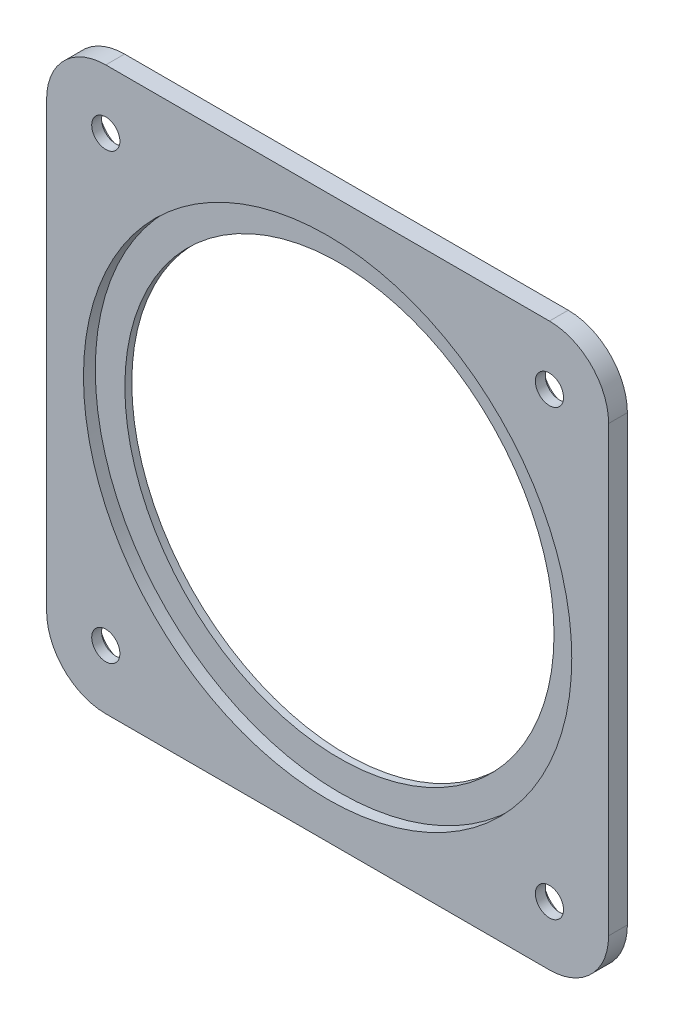
ISO-10303-21;
HEADER;
FILE_DESCRIPTION(('STEP AP214'),'2;1');
FILE_NAME('part.step','',(''),(''),'','','');
FILE_SCHEMA(('AUTOMOTIVE_DESIGN { 1 0 10303 214 1 1 1 1 }'));
ENDSEC;
DATA;
#1=APPLICATION_CONTEXT('core data for automotive mechanical design processes');
#2=APPLICATION_PROTOCOL_DEFINITION('international standard','automotive_design',2000,#1);
#3=PRODUCT_CONTEXT('',#1,'mechanical');
#4=PRODUCT('Part','Part','',(#3));
#5=PRODUCT_RELATED_PRODUCT_CATEGORY('part','',(#4));
#6=PRODUCT_DEFINITION_FORMATION('','',#4);
#7=PRODUCT_DEFINITION_CONTEXT('part definition',#1,'design');
#8=PRODUCT_DEFINITION('design','',#6,#7);
#9=PRODUCT_DEFINITION_SHAPE('','',#8);
#10=(LENGTH_UNIT() NAMED_UNIT(*) SI_UNIT(.MILLI.,.METRE.));
#11=(NAMED_UNIT(*) PLANE_ANGLE_UNIT() SI_UNIT($,.RADIAN.));
#12=(NAMED_UNIT(*) SI_UNIT($,.STERADIAN.) SOLID_ANGLE_UNIT());
#13=UNCERTAINTY_MEASURE_WITH_UNIT(LENGTH_MEASURE(1.E-05),#10,'distance_accuracy_value','');
#14=(GEOMETRIC_REPRESENTATION_CONTEXT(3) GLOBAL_UNCERTAINTY_ASSIGNED_CONTEXT((#13)) GLOBAL_UNIT_ASSIGNED_CONTEXT((#10,
#11,#12)) REPRESENTATION_CONTEXT('',''));
#15=CARTESIAN_POINT('',(0.,0.,0.));
#16=DIRECTION('',(0.,0.,1.));
#17=DIRECTION('',(1.,0.,0.));
#18=AXIS2_PLACEMENT_3D('',#15,#16,#17);
#19=CARTESIAN_POINT('',(-75.,75.,6.35));
#20=DIRECTION('',(0.,0.,-1.));
#21=DIRECTION('',(-1.,0.,0.));
#22=AXIS2_PLACEMENT_3D('',#19,#20,#21);
#23=CYLINDRICAL_SURFACE('',#22,4.7625);
#24=CARTESIAN_POINT('',(-75.,75.,6.35));
#25=DIRECTION('',(0.,0.,1.));
#26=DIRECTION('',(1.,0.,0.));
#27=AXIS2_PLACEMENT_3D('',#24,#25,#26);
#28=CIRCLE('',#27,4.7625);
#29=CARTESIAN_POINT('',(-70.2375,75.,6.35));
#30=VERTEX_POINT('',#29);
#31=EDGE_CURVE('E233',#30,#30,#28,.T.);
#32=ORIENTED_EDGE('',*,*,#31,.T.);
#33=EDGE_LOOP('',(#32));
#34=FACE_BOUND('',#33,.T.);
#35=CARTESIAN_POINT('',(-75.,75.,3.));
#36=DIRECTION('',(0.,0.,-1.));
#37=DIRECTION('',(-1.,0.,0.));
#38=AXIS2_PLACEMENT_3D('',#35,#36,#37);
#39=CIRCLE('',#38,4.7625);
#40=CARTESIAN_POINT('',(-79.7625,75.,3.));
#41=VERTEX_POINT('',#40);
#42=EDGE_CURVE('E46',#41,#41,#39,.T.);
#43=ORIENTED_EDGE('',*,*,#42,.T.);
#44=EDGE_LOOP('',(#43));
#45=FACE_BOUND('',#44,.T.);
#46=ADVANCED_FACE('F42',(#34,#45),#23,.F.);
#47=CARTESIAN_POINT('',(75.0000000000003,74.9999999999997,6.35));
#48=DIRECTION('',(0.,0.,-1.));
#49=DIRECTION('',(-1.,0.,0.));
#50=AXIS2_PLACEMENT_3D('',#47,#48,#49);
#51=CYLINDRICAL_SURFACE('',#50,4.76249999999999);
#52=CARTESIAN_POINT('',(75.0000000000003,74.9999999999997,6.35));
#53=DIRECTION('',(0.,0.,1.));
#54=DIRECTION('',(1.,0.,0.));
#55=AXIS2_PLACEMENT_3D('',#52,#53,#54);
#56=CIRCLE('',#55,4.76249999999999);
#57=CARTESIAN_POINT('',(79.7625000000003,74.9999999999997,6.35));
#58=VERTEX_POINT('',#57);
#59=EDGE_CURVE('E229',#58,#58,#56,.T.);
#60=ORIENTED_EDGE('',*,*,#59,.T.);
#61=EDGE_LOOP('',(#60));
#62=FACE_BOUND('',#61,.T.);
#63=CARTESIAN_POINT('',(75.0000000000003,74.9999999999997,3.));
#64=DIRECTION('',(0.,0.,-1.));
#65=DIRECTION('',(-1.,0.,0.));
#66=AXIS2_PLACEMENT_3D('',#63,#64,#65);
#67=CIRCLE('',#66,4.76249999999999);
#68=CARTESIAN_POINT('',(70.2375000000003,74.9999999999997,3.));
#69=VERTEX_POINT('',#68);
#70=EDGE_CURVE('E202',#69,#69,#67,.T.);
#71=ORIENTED_EDGE('',*,*,#70,.T.);
#72=EDGE_LOOP('',(#71));
#73=FACE_BOUND('',#72,.T.);
#74=ADVANCED_FACE('F282',(#62,#73),#51,.F.);
#75=CARTESIAN_POINT('',(74.9999999999995,-75.0000000000005,6.35));
#76=DIRECTION('',(0.,0.,-1.));
#77=DIRECTION('',(-1.,0.,0.));
#78=AXIS2_PLACEMENT_3D('',#75,#76,#77);
#79=CYLINDRICAL_SURFACE('',#78,4.76249999999998);
#80=CARTESIAN_POINT('',(74.9999999999995,-75.0000000000005,6.35));
#81=DIRECTION('',(0.,0.,1.));
#82=DIRECTION('',(1.,0.,0.));
#83=AXIS2_PLACEMENT_3D('',#80,#81,#82);
#84=CIRCLE('',#83,4.76249999999998);
#85=CARTESIAN_POINT('',(79.7624999999994,-75.0000000000005,6.35));
#86=VERTEX_POINT('',#85);
#87=EDGE_CURVE('E225',#86,#86,#84,.T.);
#88=ORIENTED_EDGE('',*,*,#87,.T.);
#89=EDGE_LOOP('',(#88));
#90=FACE_BOUND('',#89,.T.);
#91=CARTESIAN_POINT('',(74.9999999999995,-75.0000000000005,3.));
#92=DIRECTION('',(0.,0.,-1.));
#93=DIRECTION('',(-1.,0.,0.));
#94=AXIS2_PLACEMENT_3D('',#91,#92,#93);
#95=CIRCLE('',#94,4.76249999999998);
#96=CARTESIAN_POINT('',(70.2374999999995,-75.0000000000005,3.));
#97=VERTEX_POINT('',#96);
#98=EDGE_CURVE('E198',#97,#97,#95,.T.);
#99=ORIENTED_EDGE('',*,*,#98,.T.);
#100=EDGE_LOOP('',(#99));
#101=FACE_BOUND('',#100,.T.);
#102=ADVANCED_FACE('F288',(#90,#101),#79,.F.);
#103=CARTESIAN_POINT('',(-75.0000000000008,-74.9999999999992,6.35));
#104=DIRECTION('',(0.,0.,-1.));
#105=DIRECTION('',(-1.,0.,0.));
#106=AXIS2_PLACEMENT_3D('',#103,#104,#105);
#107=CYLINDRICAL_SURFACE('',#106,4.76249999999999);
#108=CARTESIAN_POINT('',(-75.0000000000008,-74.9999999999992,6.35));
#109=DIRECTION('',(0.,0.,1.));
#110=DIRECTION('',(1.,0.,0.));
#111=AXIS2_PLACEMENT_3D('',#108,#109,#110);
#112=CIRCLE('',#111,4.76249999999999);
#113=CARTESIAN_POINT('',(-70.2375000000008,-74.9999999999992,6.35));
#114=VERTEX_POINT('',#113);
#115=EDGE_CURVE('E192',#114,#114,#112,.T.);
#116=ORIENTED_EDGE('',*,*,#115,.T.);
#117=EDGE_LOOP('',(#116));
#118=FACE_BOUND('',#117,.T.);
#119=CARTESIAN_POINT('',(-75.0000000000008,-74.9999999999992,3.));
#120=DIRECTION('',(0.,0.,-1.));
#121=DIRECTION('',(-1.,0.,0.));
#122=AXIS2_PLACEMENT_3D('',#119,#120,#121);
#123=CIRCLE('',#122,4.76249999999999);
#124=CARTESIAN_POINT('',(-79.7625000000008,-74.9999999999992,3.));
#125=VERTEX_POINT('',#124);
#126=EDGE_CURVE('E194',#125,#125,#123,.T.);
#127=ORIENTED_EDGE('',*,*,#126,.T.);
#128=EDGE_LOOP('',(#127));
#129=FACE_BOUND('',#128,.T.);
#130=ADVANCED_FACE('F296',(#118,#129),#107,.F.);
#131=CARTESIAN_POINT('',(0.,0.,6.35));
#132=DIRECTION('',(0.,0.,-1.));
#133=DIRECTION('',(-1.,0.,0.));
#134=AXIS2_PLACEMENT_3D('',#131,#132,#133);
#135=CYLINDRICAL_SURFACE('',#134,72.55);
#136=CARTESIAN_POINT('',(0.,0.,0.));
#137=DIRECTION('',(0.,0.,1.));
#138=DIRECTION('',(1.,0.,0.));
#139=AXIS2_PLACEMENT_3D('',#136,#137,#138);
#140=CIRCLE('',#139,72.55);
#141=CARTESIAN_POINT('',(72.55,0.,0.));
#142=VERTEX_POINT('',#141);
#143=EDGE_CURVE('E152',#142,#142,#140,.T.);
#144=ORIENTED_EDGE('',*,*,#143,.F.);
#145=EDGE_LOOP('',(#144));
#146=FACE_BOUND('',#145,.T.);
#147=CARTESIAN_POINT('',(0.,0.,2.35));
#148=DIRECTION('',(0.,0.,1.));
#149=DIRECTION('',(1.,0.,0.));
#150=AXIS2_PLACEMENT_3D('',#147,#148,#149);
#151=CIRCLE('',#150,72.55);
#152=CARTESIAN_POINT('',(72.55,0.,2.35));
#153=VERTEX_POINT('',#152);
#154=EDGE_CURVE('E188',#153,#153,#151,.T.);
#155=ORIENTED_EDGE('',*,*,#154,.T.);
#156=EDGE_LOOP('',(#155));
#157=FACE_BOUND('',#156,.T.);
#158=ADVANCED_FACE('F293',(#146,#157),#135,.F.);
#159=CARTESIAN_POINT('',(75.,-75.,6.35));
#160=DIRECTION('',(0.,0.,1.));
#161=DIRECTION('',(1.,0.,0.));
#162=AXIS2_PLACEMENT_3D('',#159,#160,#161);
#163=PLANE('',#162);
#164=CARTESIAN_POINT('',(0.,0.,6.35));
#165=DIRECTION('',(0.,0.,1.));
#166=DIRECTION('',(1.,0.,0.));
#167=AXIS2_PLACEMENT_3D('',#164,#165,#166);
#168=CIRCLE('',#167,82.55);
#169=CARTESIAN_POINT('',(82.55,0.,6.35));
#170=VERTEX_POINT('',#169);
#171=EDGE_CURVE('E209',#170,#170,#168,.T.);
#172=ORIENTED_EDGE('',*,*,#171,.F.);
#173=EDGE_LOOP('',(#172));
#174=FACE_BOUND('',#173,.T.);
#175=ORIENTED_EDGE('',*,*,#87,.F.);
#176=EDGE_LOOP('',(#175));
#177=FACE_BOUND('',#176,.T.);
#178=ORIENTED_EDGE('',*,*,#31,.F.);
#179=EDGE_LOOP('',(#178));
#180=FACE_BOUND('',#179,.T.);
#181=CARTESIAN_POINT('',(75.,-75.,6.35));
#182=DIRECTION('',(0.,0.,1.));
#183=DIRECTION('',(1.,0.,0.));
#184=AXIS2_PLACEMENT_3D('',#181,#182,#183);
#185=CIRCLE('',#184,20.);
#186=CARTESIAN_POINT('',(75.,-95.,6.35));
#187=VERTEX_POINT('',#186);
#188=CARTESIAN_POINT('',(95.,-75.,6.35));
#189=VERTEX_POINT('',#188);
#190=EDGE_CURVE('E170',#187,#189,#185,.T.);
#191=ORIENTED_EDGE('',*,*,#190,.T.);
#192=DIRECTION('',(0.,1.,0.));
#193=VECTOR('',#192,1.);
#194=CARTESIAN_POINT('',(95.,-75.,6.35));
#195=LINE('',#194,#193);
#196=CARTESIAN_POINT('',(95.,75.,6.35));
#197=VERTEX_POINT('',#196);
#198=EDGE_CURVE('E105',#189,#197,#195,.T.);
#199=ORIENTED_EDGE('',*,*,#198,.T.);
#200=CARTESIAN_POINT('',(75.,75.,6.35));
#201=DIRECTION('',(0.,0.,1.));
#202=DIRECTION('',(-1.,0.,0.));
#203=AXIS2_PLACEMENT_3D('',#200,#201,#202);
#204=CIRCLE('',#203,20.);
#205=CARTESIAN_POINT('',(75.,95.,6.35));
#206=VERTEX_POINT('',#205);
#207=EDGE_CURVE('E244',#197,#206,#204,.T.);
#208=ORIENTED_EDGE('',*,*,#207,.T.);
#209=DIRECTION('',(-1.,0.,0.));
#210=VECTOR('',#209,1.);
#211=CARTESIAN_POINT('',(-75.,95.,6.35));
#212=LINE('',#211,#210);
#213=CARTESIAN_POINT('',(-75.,95.,6.35));
#214=VERTEX_POINT('',#213);
#215=EDGE_CURVE('E247',#206,#214,#212,.T.);
#216=ORIENTED_EDGE('',*,*,#215,.T.);
#217=CARTESIAN_POINT('',(-75.,75.,6.35));
#218=DIRECTION('',(0.,0.,1.));
#219=DIRECTION('',(-1.,0.,0.));
#220=AXIS2_PLACEMENT_3D('',#217,#218,#219);
#221=CIRCLE('',#220,20.);
#222=CARTESIAN_POINT('',(-95.,75.,6.35));
#223=VERTEX_POINT('',#222);
#224=EDGE_CURVE('E125',#214,#223,#221,.T.);
#225=ORIENTED_EDGE('',*,*,#224,.T.);
#226=DIRECTION('',(0.,-1.,0.));
#227=VECTOR('',#226,1.);
#228=CARTESIAN_POINT('',(-95.,-75.,6.35));
#229=LINE('',#228,#227);
#230=CARTESIAN_POINT('',(-95.,-75.,6.35));
#231=VERTEX_POINT('',#230);
#232=EDGE_CURVE('E118',#223,#231,#229,.T.);
#233=ORIENTED_EDGE('',*,*,#232,.T.);
#234=CARTESIAN_POINT('',(-75.,-75.,6.35));
#235=DIRECTION('',(0.,0.,1.));
#236=DIRECTION('',(-1.,0.,0.));
#237=AXIS2_PLACEMENT_3D('',#234,#235,#236);
#238=CIRCLE('',#237,20.);
#239=CARTESIAN_POINT('',(-75.,-95.,6.35));
#240=VERTEX_POINT('',#239);
#241=EDGE_CURVE('E123',#231,#240,#238,.T.);
#242=ORIENTED_EDGE('',*,*,#241,.T.);
#243=DIRECTION('',(1.,0.,0.));
#244=VECTOR('',#243,1.);
#245=CARTESIAN_POINT('',(-75.,-95.,6.35));
#246=LINE('',#245,#244);
#247=EDGE_CURVE('E62',#240,#187,#246,.T.);
#248=ORIENTED_EDGE('',*,*,#247,.T.);
#249=EDGE_LOOP('',(#191,#199,#208,#216,#225,#233,#242,#248));
#250=FACE_BOUND('',#249,.T.);
#251=ORIENTED_EDGE('',*,*,#59,.F.);
#252=EDGE_LOOP('',(#251));
#253=FACE_BOUND('',#252,.T.);
#254=ORIENTED_EDGE('',*,*,#115,.F.);
#255=EDGE_LOOP('',(#254));
#256=FACE_BOUND('',#255,.T.);
#257=ADVANCED_FACE('F120',(#174,#177,#180,#250,#253,#256),#163,.T.);
#258=CARTESIAN_POINT('',(75.,-75.,0.));
#259=DIRECTION('',(0.,0.,1.));
#260=DIRECTION('',(1.,0.,0.));
#261=AXIS2_PLACEMENT_3D('',#258,#259,#260);
#262=PLANE('',#261);
#263=CARTESIAN_POINT('',(75.0000000000005,-74.9999999999995,0.));
#264=DIRECTION('',(0.,0.,-1.));
#265=DIRECTION('',(-1.,0.,0.));
#266=AXIS2_PLACEMENT_3D('',#263,#264,#265);
#267=CIRCLE('',#266,8.5);
#268=CARTESIAN_POINT('',(66.5000000000005,-74.9999999999995,0.));
#269=VERTEX_POINT('',#268);
#270=EDGE_CURVE('E309',#269,#269,#267,.T.);
#271=ORIENTED_EDGE('',*,*,#270,.F.);
#272=EDGE_LOOP('',(#271));
#273=FACE_BOUND('',#272,.T.);
#274=CARTESIAN_POINT('',(-74.9999999999997,-75.0000000000002,0.));
#275=DIRECTION('',(0.,0.,-1.));
#276=DIRECTION('',(-1.,0.,0.));
#277=AXIS2_PLACEMENT_3D('',#274,#275,#276);
#278=CIRCLE('',#277,8.50000000000001);
#279=CARTESIAN_POINT('',(-83.4999999999998,-75.0000000000002,0.));
#280=VERTEX_POINT('',#279);
#281=EDGE_CURVE('E313',#280,#280,#278,.T.);
#282=ORIENTED_EDGE('',*,*,#281,.F.);
#283=EDGE_LOOP('',(#282));
#284=FACE_BOUND('',#283,.T.);
#285=CARTESIAN_POINT('',(-75.,75.,0.));
#286=DIRECTION('',(0.,0.,-1.));
#287=DIRECTION('',(-1.,0.,0.));
#288=AXIS2_PLACEMENT_3D('',#285,#286,#287);
#289=CIRCLE('',#288,8.5);
#290=CARTESIAN_POINT('',(-83.5,75.,0.));
#291=VERTEX_POINT('',#290);
#292=EDGE_CURVE('E317',#291,#291,#289,.T.);
#293=ORIENTED_EDGE('',*,*,#292,.F.);
#294=EDGE_LOOP('',(#293));
#295=FACE_BOUND('',#294,.T.);
#296=CARTESIAN_POINT('',(75.0000000000003,74.9999999999997,0.));
#297=DIRECTION('',(0.,0.,-1.));
#298=DIRECTION('',(-1.,0.,0.));
#299=AXIS2_PLACEMENT_3D('',#296,#297,#298);
#300=CIRCLE('',#299,8.50000000000001);
#301=CARTESIAN_POINT('',(66.5000000000003,74.9999999999997,0.));
#302=VERTEX_POINT('',#301);
#303=EDGE_CURVE('E320',#302,#302,#300,.T.);
#304=ORIENTED_EDGE('',*,*,#303,.F.);
#305=EDGE_LOOP('',(#304));
#306=FACE_BOUND('',#305,.T.);
#307=CARTESIAN_POINT('',(75.,-75.,0.));
#308=DIRECTION('',(0.,0.,1.));
#309=DIRECTION('',(1.,0.,0.));
#310=AXIS2_PLACEMENT_3D('',#307,#308,#309);
#311=CIRCLE('',#310,20.);
#312=CARTESIAN_POINT('',(75.,-95.,0.));
#313=VERTEX_POINT('',#312);
#314=CARTESIAN_POINT('',(95.,-75.,0.));
#315=VERTEX_POINT('',#314);
#316=EDGE_CURVE('E147',#313,#315,#311,.T.);
#317=ORIENTED_EDGE('',*,*,#316,.F.);
#318=DIRECTION('',(1.,0.,0.));
#319=VECTOR('',#318,1.);
#320=CARTESIAN_POINT('',(-75.,-95.,0.));
#321=LINE('',#320,#319);
#322=CARTESIAN_POINT('',(-75.,-95.,0.));
#323=VERTEX_POINT('',#322);
#324=EDGE_CURVE('E97',#323,#313,#321,.T.);
#325=ORIENTED_EDGE('',*,*,#324,.F.);
#326=CARTESIAN_POINT('',(-75.,-75.,0.));
#327=DIRECTION('',(0.,0.,1.));
#328=DIRECTION('',(-1.,0.,0.));
#329=AXIS2_PLACEMENT_3D('',#326,#327,#328);
#330=CIRCLE('',#329,20.);
#331=CARTESIAN_POINT('',(-95.,-75.,0.));
#332=VERTEX_POINT('',#331);
#333=EDGE_CURVE('E91',#332,#323,#330,.T.);
#334=ORIENTED_EDGE('',*,*,#333,.F.);
#335=DIRECTION('',(0.,-1.,0.));
#336=VECTOR('',#335,1.);
#337=CARTESIAN_POINT('',(-95.,-75.,0.));
#338=LINE('',#337,#336);
#339=CARTESIAN_POINT('',(-95.,75.,0.));
#340=VERTEX_POINT('',#339);
#341=EDGE_CURVE('E134',#340,#332,#338,.T.);
#342=ORIENTED_EDGE('',*,*,#341,.F.);
#343=CARTESIAN_POINT('',(-75.,75.,0.));
#344=DIRECTION('',(0.,0.,1.));
#345=DIRECTION('',(-1.,0.,0.));
#346=AXIS2_PLACEMENT_3D('',#343,#344,#345);
#347=CIRCLE('',#346,20.);
#348=CARTESIAN_POINT('',(-75.,95.,0.));
#349=VERTEX_POINT('',#348);
#350=EDGE_CURVE('E161',#349,#340,#347,.T.);
#351=ORIENTED_EDGE('',*,*,#350,.F.);
#352=DIRECTION('',(-1.,0.,0.));
#353=VECTOR('',#352,1.);
#354=CARTESIAN_POINT('',(-75.,95.,0.));
#355=LINE('',#354,#353);
#356=CARTESIAN_POINT('',(75.,95.,0.));
#357=VERTEX_POINT('',#356);
#358=EDGE_CURVE('E158',#357,#349,#355,.T.);
#359=ORIENTED_EDGE('',*,*,#358,.F.);
#360=CARTESIAN_POINT('',(75.,75.,0.));
#361=DIRECTION('',(0.,0.,1.));
#362=DIRECTION('',(-1.,0.,0.));
#363=AXIS2_PLACEMENT_3D('',#360,#361,#362);
#364=CIRCLE('',#363,20.);
#365=CARTESIAN_POINT('',(95.,75.,0.));
#366=VERTEX_POINT('',#365);
#367=EDGE_CURVE('E155',#366,#357,#364,.T.);
#368=ORIENTED_EDGE('',*,*,#367,.F.);
#369=DIRECTION('',(0.,1.,0.));
#370=VECTOR('',#369,1.);
#371=CARTESIAN_POINT('',(95.,-75.,0.));
#372=LINE('',#371,#370);
#373=EDGE_CURVE('E151',#315,#366,#372,.T.);
#374=ORIENTED_EDGE('',*,*,#373,.F.);
#375=EDGE_LOOP('',(#317,#325,#334,#342,#351,#359,#368,#374));
#376=FACE_BOUND('',#375,.T.);
#377=ORIENTED_EDGE('',*,*,#143,.T.);
#378=EDGE_LOOP('',(#377));
#379=FACE_BOUND('',#378,.T.);
#380=ADVANCED_FACE('F262',(#273,#284,#295,#306,#376,#379),#262,.F.);
#381=CARTESIAN_POINT('',(75.,-75.,6.35));
#382=DIRECTION('',(0.,0.,-1.));
#383=DIRECTION('',(-1.,0.,0.));
#384=AXIS2_PLACEMENT_3D('',#381,#382,#383);
#385=CYLINDRICAL_SURFACE('',#384,20.);
#386=ORIENTED_EDGE('',*,*,#316,.T.);
#387=DIRECTION('',(0.,0.,-1.));
#388=VECTOR('',#387,1.);
#389=CARTESIAN_POINT('',(95.,-75.,6.35));
#390=LINE('',#389,#388);
#391=EDGE_CURVE('E11',#189,#315,#390,.T.);
#392=ORIENTED_EDGE('',*,*,#391,.F.);
#393=ORIENTED_EDGE('',*,*,#190,.F.);
#394=DIRECTION('',(0.,0.,-1.));
#395=VECTOR('',#394,1.);
#396=CARTESIAN_POINT('',(75.,-95.,6.35));
#397=LINE('',#396,#395);
#398=EDGE_CURVE('E143',#187,#313,#397,.T.);
#399=ORIENTED_EDGE('',*,*,#398,.T.);
#400=EDGE_LOOP('',(#386,#392,#393,#399));
#401=FACE_BOUND('',#400,.T.);
#402=ADVANCED_FACE('F44',(#401),#385,.T.);
#403=CARTESIAN_POINT('',(95.,-75.,6.35));
#404=DIRECTION('',(-1.,0.,0.));
#405=DIRECTION('',(0.,-1.,0.));
#406=AXIS2_PLACEMENT_3D('',#403,#404,#405);
#407=PLANE('',#406);
#408=ORIENTED_EDGE('',*,*,#373,.T.);
#409=DIRECTION('',(0.,0.,-1.));
#410=VECTOR('',#409,1.);
#411=CARTESIAN_POINT('',(95.,75.,6.35));
#412=LINE('',#411,#410);
#413=EDGE_CURVE('E53',#197,#366,#412,.T.);
#414=ORIENTED_EDGE('',*,*,#413,.F.);
#415=ORIENTED_EDGE('',*,*,#198,.F.);
#416=ORIENTED_EDGE('',*,*,#391,.T.);
#417=EDGE_LOOP('',(#408,#414,#415,#416));
#418=FACE_BOUND('',#417,.T.);
#419=ADVANCED_FACE('F305',(#418),#407,.F.);
#420=CARTESIAN_POINT('',(75.,75.,6.35));
#421=DIRECTION('',(0.,0.,-1.));
#422=DIRECTION('',(-1.,0.,0.));
#423=AXIS2_PLACEMENT_3D('',#420,#421,#422);
#424=CYLINDRICAL_SURFACE('',#423,20.);
#425=ORIENTED_EDGE('',*,*,#367,.T.);
#426=DIRECTION('',(0.,0.,-1.));
#427=VECTOR('',#426,1.);
#428=CARTESIAN_POINT('',(75.,95.,6.35));
#429=LINE('',#428,#427);
#430=EDGE_CURVE('E181',#206,#357,#429,.T.);
#431=ORIENTED_EDGE('',*,*,#430,.F.);
#432=ORIENTED_EDGE('',*,*,#207,.F.);
#433=ORIENTED_EDGE('',*,*,#413,.T.);
#434=EDGE_LOOP('',(#425,#431,#432,#433));
#435=FACE_BOUND('',#434,.T.);
#436=ADVANCED_FACE('F491',(#435),#424,.T.);
#437=CARTESIAN_POINT('',(-75.,95.,6.35));
#438=DIRECTION('',(0.,-1.,0.));
#439=DIRECTION('',(0.,0.,-1.));
#440=AXIS2_PLACEMENT_3D('',#437,#438,#439);
#441=PLANE('',#440);
#442=ORIENTED_EDGE('',*,*,#358,.T.);
#443=DIRECTION('',(0.,0.,-1.));
#444=VECTOR('',#443,1.);
#445=CARTESIAN_POINT('',(-75.,95.,6.35));
#446=LINE('',#445,#444);
#447=EDGE_CURVE('E177',#214,#349,#446,.T.);
#448=ORIENTED_EDGE('',*,*,#447,.F.);
#449=ORIENTED_EDGE('',*,*,#215,.F.);
#450=ORIENTED_EDGE('',*,*,#430,.T.);
#451=EDGE_LOOP('',(#442,#448,#449,#450));
#452=FACE_BOUND('',#451,.T.);
#453=ADVANCED_FACE('F255',(#452),#441,.F.);
#454=CARTESIAN_POINT('',(-75.,75.,6.35));
#455=DIRECTION('',(0.,0.,-1.));
#456=DIRECTION('',(-1.,0.,0.));
#457=AXIS2_PLACEMENT_3D('',#454,#455,#456);
#458=CYLINDRICAL_SURFACE('',#457,20.);
#459=ORIENTED_EDGE('',*,*,#350,.T.);
#460=DIRECTION('',(0.,0.,-1.));
#461=VECTOR('',#460,1.);
#462=CARTESIAN_POINT('',(-95.,75.,6.35));
#463=LINE('',#462,#461);
#464=EDGE_CURVE('E136',#223,#340,#463,.T.);
#465=ORIENTED_EDGE('',*,*,#464,.F.);
#466=ORIENTED_EDGE('',*,*,#224,.F.);
#467=ORIENTED_EDGE('',*,*,#447,.T.);
#468=EDGE_LOOP('',(#459,#465,#466,#467));
#469=FACE_BOUND('',#468,.T.);
#470=ADVANCED_FACE('F259',(#469),#458,.T.);
#471=CARTESIAN_POINT('',(-95.,-75.,6.35));
#472=DIRECTION('',(1.,0.,0.));
#473=DIRECTION('',(0.,0.,-1.));
#474=AXIS2_PLACEMENT_3D('',#471,#472,#473);
#475=PLANE('',#474);
#476=ORIENTED_EDGE('',*,*,#341,.T.);
#477=DIRECTION('',(0.,0.,-1.));
#478=VECTOR('',#477,1.);
#479=CARTESIAN_POINT('',(-95.,-75.,6.35));
#480=LINE('',#479,#478);
#481=EDGE_CURVE('E131',#231,#332,#480,.T.);
#482=ORIENTED_EDGE('',*,*,#481,.F.);
#483=ORIENTED_EDGE('',*,*,#232,.F.);
#484=ORIENTED_EDGE('',*,*,#464,.T.);
#485=EDGE_LOOP('',(#476,#482,#483,#484));
#486=FACE_BOUND('',#485,.T.);
#487=ADVANCED_FACE('F132',(#486),#475,.F.);
#488=CARTESIAN_POINT('',(-75.,-75.,6.35));
#489=DIRECTION('',(0.,0.,-1.));
#490=DIRECTION('',(-1.,0.,0.));
#491=AXIS2_PLACEMENT_3D('',#488,#489,#490);
#492=CYLINDRICAL_SURFACE('',#491,20.);
#493=ORIENTED_EDGE('',*,*,#333,.T.);
#494=DIRECTION('',(0.,0.,-1.));
#495=VECTOR('',#494,1.);
#496=CARTESIAN_POINT('',(-75.,-95.,6.35));
#497=LINE('',#496,#495);
#498=EDGE_CURVE('E137',#240,#323,#497,.T.);
#499=ORIENTED_EDGE('',*,*,#498,.F.);
#500=ORIENTED_EDGE('',*,*,#241,.F.);
#501=ORIENTED_EDGE('',*,*,#481,.T.);
#502=EDGE_LOOP('',(#493,#499,#500,#501));
#503=FACE_BOUND('',#502,.T.);
#504=ADVANCED_FACE('F139',(#503),#492,.T.);
#505=CARTESIAN_POINT('',(-75.,-95.,6.35));
#506=DIRECTION('',(0.,1.,0.));
#507=DIRECTION('',(0.,0.,1.));
#508=AXIS2_PLACEMENT_3D('',#505,#506,#507);
#509=PLANE('',#508);
#510=ORIENTED_EDGE('',*,*,#324,.T.);
#511=ORIENTED_EDGE('',*,*,#398,.F.);
#512=ORIENTED_EDGE('',*,*,#247,.F.);
#513=ORIENTED_EDGE('',*,*,#498,.T.);
#514=EDGE_LOOP('',(#510,#511,#512,#513));
#515=FACE_BOUND('',#514,.T.);
#516=ADVANCED_FACE('F268',(#515),#509,.F.);
#517=CARTESIAN_POINT('',(0.,0.,2.35));
#518=DIRECTION('',(0.,0.,1.));
#519=DIRECTION('',(1.,0.,0.));
#520=AXIS2_PLACEMENT_3D('',#517,#518,#519);
#521=CYLINDRICAL_SURFACE('',#520,82.55);
#522=CARTESIAN_POINT('',(0.,0.,2.35));
#523=DIRECTION('',(0.,0.,1.));
#524=DIRECTION('',(1.,0.,0.));
#525=AXIS2_PLACEMENT_3D('',#522,#523,#524);
#526=CIRCLE('',#525,82.55);
#527=CARTESIAN_POINT('',(82.55,0.,2.35));
#528=VERTEX_POINT('',#527);
#529=EDGE_CURVE('E193',#528,#528,#526,.T.);
#530=ORIENTED_EDGE('',*,*,#529,.F.);
#531=EDGE_LOOP('',(#530));
#532=FACE_BOUND('',#531,.T.);
#533=ORIENTED_EDGE('',*,*,#171,.T.);
#534=EDGE_LOOP('',(#533));
#535=FACE_BOUND('',#534,.T.);
#536=ADVANCED_FACE('F270',(#532,#535),#521,.F.);
#537=CARTESIAN_POINT('',(0.,0.,2.35));
#538=DIRECTION('',(0.,0.,1.));
#539=DIRECTION('',(1.,0.,0.));
#540=AXIS2_PLACEMENT_3D('',#537,#538,#539);
#541=PLANE('',#540);
#542=ORIENTED_EDGE('',*,*,#154,.F.);
#543=EDGE_LOOP('',(#542));
#544=FACE_BOUND('',#543,.T.);
#545=ORIENTED_EDGE('',*,*,#529,.T.);
#546=EDGE_LOOP('',(#545));
#547=FACE_BOUND('',#546,.T.);
#548=ADVANCED_FACE('F276',(#544,#547),#541,.T.);
#549=CARTESIAN_POINT('',(-74.9999999999997,-75.0000000000002,3.));
#550=DIRECTION('',(0.,0.,-1.));
#551=DIRECTION('',(-1.,0.,0.));
#552=AXIS2_PLACEMENT_3D('',#549,#550,#551);
#553=CYLINDRICAL_SURFACE('',#552,8.50000000000001);
#554=CARTESIAN_POINT('',(-74.9999999999997,-75.0000000000002,3.));
#555=DIRECTION('',(0.,0.,-1.));
#556=DIRECTION('',(-1.,0.,0.));
#557=AXIS2_PLACEMENT_3D('',#554,#555,#556);
#558=CIRCLE('',#557,8.50000000000001);
#559=CARTESIAN_POINT('',(-83.4999999999998,-75.0000000000002,3.));
#560=VERTEX_POINT('',#559);
#561=EDGE_CURVE('E336',#560,#560,#558,.T.);
#562=ORIENTED_EDGE('',*,*,#561,.F.);
#563=EDGE_LOOP('',(#562));
#564=FACE_BOUND('',#563,.T.);
#565=ORIENTED_EDGE('',*,*,#281,.T.);
#566=EDGE_LOOP('',(#565));
#567=FACE_BOUND('',#566,.T.);
#568=ADVANCED_FACE('F363',(#564,#567),#553,.F.);
#569=CARTESIAN_POINT('',(-74.9999999999997,-75.0000000000002,3.));
#570=DIRECTION('',(0.,0.,-1.));
#571=DIRECTION('',(-1.,0.,0.));
#572=AXIS2_PLACEMENT_3D('',#569,#570,#571);
#573=PLANE('',#572);
#574=ORIENTED_EDGE('',*,*,#126,.F.);
#575=EDGE_LOOP('',(#574));
#576=FACE_BOUND('',#575,.T.);
#577=ORIENTED_EDGE('',*,*,#561,.T.);
#578=EDGE_LOOP('',(#577));
#579=FACE_BOUND('',#578,.T.);
#580=ADVANCED_FACE('F366',(#576,#579),#573,.T.);
#581=CARTESIAN_POINT('',(75.0000000000005,-74.9999999999995,3.));
#582=DIRECTION('',(0.,0.,-1.));
#583=DIRECTION('',(-1.,0.,0.));
#584=AXIS2_PLACEMENT_3D('',#581,#582,#583);
#585=CYLINDRICAL_SURFACE('',#584,8.5);
#586=CARTESIAN_POINT('',(75.0000000000005,-74.9999999999995,3.));
#587=DIRECTION('',(0.,0.,-1.));
#588=DIRECTION('',(-1.,0.,0.));
#589=AXIS2_PLACEMENT_3D('',#586,#587,#588);
#590=CIRCLE('',#589,8.5);
#591=CARTESIAN_POINT('',(66.5000000000005,-74.9999999999995,3.));
#592=VERTEX_POINT('',#591);
#593=EDGE_CURVE('E330',#592,#592,#590,.T.);
#594=ORIENTED_EDGE('',*,*,#593,.F.);
#595=EDGE_LOOP('',(#594));
#596=FACE_BOUND('',#595,.T.);
#597=ORIENTED_EDGE('',*,*,#270,.T.);
#598=EDGE_LOOP('',(#597));
#599=FACE_BOUND('',#598,.T.);
#600=ADVANCED_FACE('F370',(#596,#599),#585,.F.);
#601=CARTESIAN_POINT('',(75.0000000000005,-74.9999999999995,3.));
#602=DIRECTION('',(0.,0.,-1.));
#603=DIRECTION('',(-1.,0.,0.));
#604=AXIS2_PLACEMENT_3D('',#601,#602,#603);
#605=PLANE('',#604);
#606=ORIENTED_EDGE('',*,*,#98,.F.);
#607=EDGE_LOOP('',(#606));
#608=FACE_BOUND('',#607,.T.);
#609=ORIENTED_EDGE('',*,*,#593,.T.);
#610=EDGE_LOOP('',(#609));
#611=FACE_BOUND('',#610,.T.);
#612=ADVANCED_FACE('F374',(#608,#611),#605,.T.);
#613=CARTESIAN_POINT('',(75.0000000000003,74.9999999999997,3.));
#614=DIRECTION('',(0.,0.,-1.));
#615=DIRECTION('',(-1.,0.,0.));
#616=AXIS2_PLACEMENT_3D('',#613,#614,#615);
#617=CYLINDRICAL_SURFACE('',#616,8.50000000000001);
#618=CARTESIAN_POINT('',(75.0000000000003,74.9999999999997,3.));
#619=DIRECTION('',(0.,0.,-1.));
#620=DIRECTION('',(-1.,0.,0.));
#621=AXIS2_PLACEMENT_3D('',#618,#619,#620);
#622=CIRCLE('',#621,8.50000000000001);
#623=CARTESIAN_POINT('',(66.5000000000003,74.9999999999997,3.));
#624=VERTEX_POINT('',#623);
#625=EDGE_CURVE('E199',#624,#624,#622,.T.);
#626=ORIENTED_EDGE('',*,*,#625,.F.);
#627=EDGE_LOOP('',(#626));
#628=FACE_BOUND('',#627,.T.);
#629=ORIENTED_EDGE('',*,*,#303,.T.);
#630=EDGE_LOOP('',(#629));
#631=FACE_BOUND('',#630,.T.);
#632=ADVANCED_FACE('F359',(#628,#631),#617,.F.);
#633=CARTESIAN_POINT('',(75.0000000000003,74.9999999999997,3.));
#634=DIRECTION('',(0.,0.,-1.));
#635=DIRECTION('',(-1.,0.,0.));
#636=AXIS2_PLACEMENT_3D('',#633,#634,#635);
#637=PLANE('',#636);
#638=ORIENTED_EDGE('',*,*,#70,.F.);
#639=EDGE_LOOP('',(#638));
#640=FACE_BOUND('',#639,.T.);
#641=ORIENTED_EDGE('',*,*,#625,.T.);
#642=EDGE_LOOP('',(#641));
#643=FACE_BOUND('',#642,.T.);
#644=ADVANCED_FACE('F351',(#640,#643),#637,.T.);
#645=CARTESIAN_POINT('',(-75.,75.,3.));
#646=DIRECTION('',(0.,0.,-1.));
#647=DIRECTION('',(-1.,0.,0.));
#648=AXIS2_PLACEMENT_3D('',#645,#646,#647);
#649=CYLINDRICAL_SURFACE('',#648,8.5);
#650=CARTESIAN_POINT('',(-75.,75.,3.));
#651=DIRECTION('',(0.,0.,-1.));
#652=DIRECTION('',(-1.,0.,0.));
#653=AXIS2_PLACEMENT_3D('',#650,#651,#652);
#654=CIRCLE('',#653,8.5);
#655=CARTESIAN_POINT('',(-83.5,75.,3.));
#656=VERTEX_POINT('',#655);
#657=EDGE_CURVE('E327',#656,#656,#654,.T.);
#658=ORIENTED_EDGE('',*,*,#657,.F.);
#659=EDGE_LOOP('',(#658));
#660=FACE_BOUND('',#659,.T.);
#661=ORIENTED_EDGE('',*,*,#292,.T.);
#662=EDGE_LOOP('',(#661));
#663=FACE_BOUND('',#662,.T.);
#664=ADVANCED_FACE('F348',(#660,#663),#649,.F.);
#665=CARTESIAN_POINT('',(-75.,75.,3.));
#666=DIRECTION('',(0.,0.,-1.));
#667=DIRECTION('',(-1.,0.,0.));
#668=AXIS2_PLACEMENT_3D('',#665,#666,#667);
#669=PLANE('',#668);
#670=ORIENTED_EDGE('',*,*,#42,.F.);
#671=EDGE_LOOP('',(#670));
#672=FACE_BOUND('',#671,.T.);
#673=ORIENTED_EDGE('',*,*,#657,.T.);
#674=EDGE_LOOP('',(#673));
#675=FACE_BOUND('',#674,.T.);
#676=ADVANCED_FACE('F346',(#672,#675),#669,.T.);
#677=CLOSED_SHELL('',(#46,#74,#102,#130,#158,#257,#380,#402,#419,#436,#453,#470,#487,#504,#516,
#536,#548,#568,#580,#600,#612,#632,#644,#664,#676));
#678=MANIFOLD_SOLID_BREP('B2',#677);
#679=ADVANCED_BREP_SHAPE_REPRESENTATION('',(#18,#678),#14);
#680=SHAPE_DEFINITION_REPRESENTATION(#9,#679);
ENDSEC;
END-ISO-10303-21;
